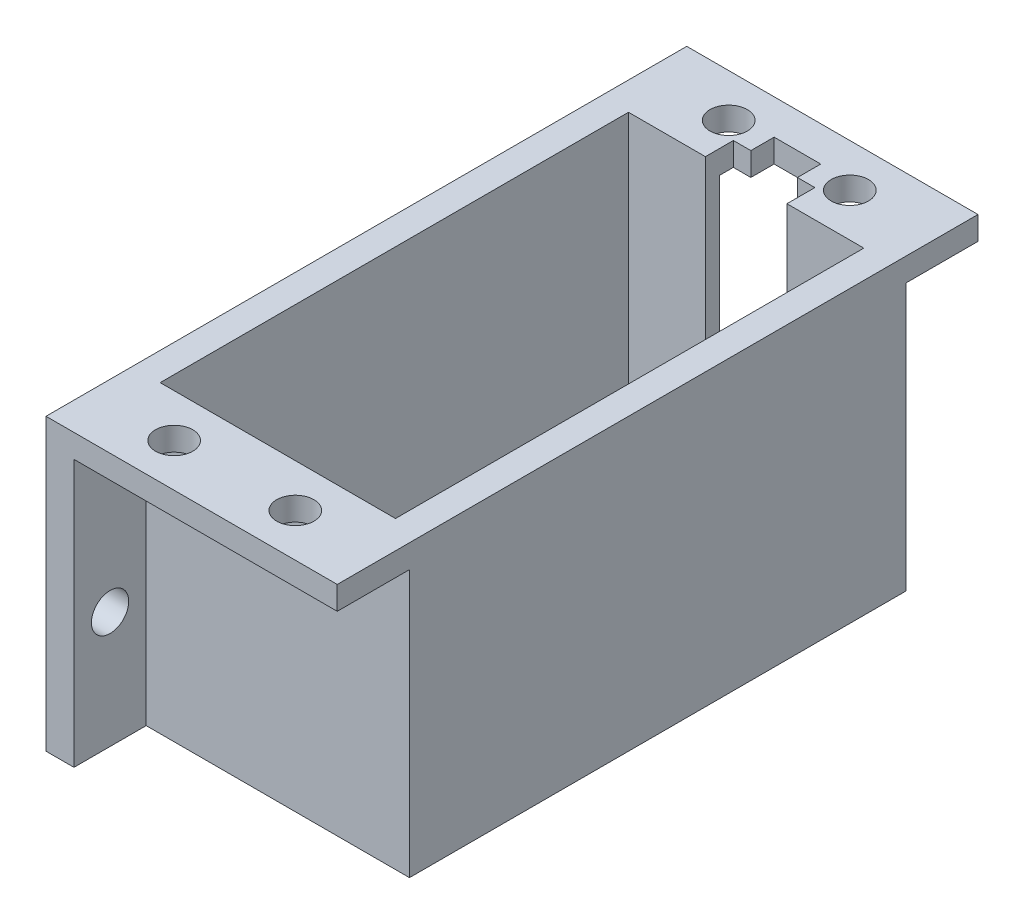
ISO-10303-21;
HEADER;
FILE_DESCRIPTION(('STEP AP214'),'2;1');
FILE_NAME('part.step','',(''),(''),'','','');
FILE_SCHEMA(('AUTOMOTIVE_DESIGN { 1 0 10303 214 1 1 1 1 }'));
ENDSEC;
DATA;
#1=APPLICATION_CONTEXT('core data for automotive mechanical design processes');
#2=APPLICATION_PROTOCOL_DEFINITION('international standard','automotive_design',2000,#1);
#3=PRODUCT_CONTEXT('',#1,'mechanical');
#4=PRODUCT('Part','Part','',(#3));
#5=PRODUCT_RELATED_PRODUCT_CATEGORY('part','',(#4));
#6=PRODUCT_DEFINITION_FORMATION('','',#4);
#7=PRODUCT_DEFINITION_CONTEXT('part definition',#1,'design');
#8=PRODUCT_DEFINITION('design','',#6,#7);
#9=PRODUCT_DEFINITION_SHAPE('','',#8);
#10=(LENGTH_UNIT() NAMED_UNIT(*) SI_UNIT(.MILLI.,.METRE.));
#11=(NAMED_UNIT(*) PLANE_ANGLE_UNIT() SI_UNIT($,.RADIAN.));
#12=(NAMED_UNIT(*) SI_UNIT($,.STERADIAN.) SOLID_ANGLE_UNIT());
#13=UNCERTAINTY_MEASURE_WITH_UNIT(LENGTH_MEASURE(1.E-05),#10,'distance_accuracy_value','');
#14=(GEOMETRIC_REPRESENTATION_CONTEXT(3) GLOBAL_UNCERTAINTY_ASSIGNED_CONTEXT((#13)) GLOBAL_UNIT_ASSIGNED_CONTEXT((#10,
#11,#12)) REPRESENTATION_CONTEXT('',''));
#15=CARTESIAN_POINT('',(0.,0.,0.));
#16=DIRECTION('',(0.,0.,1.));
#17=DIRECTION('',(1.,0.,0.));
#18=AXIS2_PLACEMENT_3D('',#15,#16,#17);
#19=CARTESIAN_POINT('',(12.5,-31.100643080168,4.));
#20=DIRECTION('',(1.,0.,0.));
#21=DIRECTION('',(0.,0.,-1.));
#22=AXIS2_PLACEMENT_3D('',#19,#20,#21);
#23=PLANE('',#22);
#24=DIRECTION('',(0.,0.,-1.));
#25=VECTOR('',#24,1.);
#26=CARTESIAN_POINT('',(12.5,24.9,4.));
#27=LINE('',#26,#25);
#28=CARTESIAN_POINT('',(12.5,24.9,27.5));
#29=VERTEX_POINT('',#28);
#30=CARTESIAN_POINT('',(12.5,24.9,21.3));
#31=VERTEX_POINT('',#30);
#32=EDGE_CURVE('E212',#29,#31,#27,.T.);
#33=ORIENTED_EDGE('',*,*,#32,.T.);
#34=DIRECTION('',(0.,-1.,0.));
#35=VECTOR('',#34,1.);
#36=CARTESIAN_POINT('',(12.5,-31.100643080168,21.3));
#37=LINE('',#36,#35);
#38=CARTESIAN_POINT('',(12.5,2.,21.3));
#39=VERTEX_POINT('',#38);
#40=EDGE_CURVE('E198',#31,#39,#37,.T.);
#41=ORIENTED_EDGE('',*,*,#40,.T.);
#42=DIRECTION('',(0.,0.,1.));
#43=VECTOR('',#42,1.);
#44=CARTESIAN_POINT('',(12.5,2.,4.));
#45=LINE('',#44,#43);
#46=CARTESIAN_POINT('',(12.5,2.,-21.3));
#47=VERTEX_POINT('',#46);
#48=EDGE_CURVE('E210',#47,#39,#45,.T.);
#49=ORIENTED_EDGE('',*,*,#48,.F.);
#50=DIRECTION('',(0.,1.,0.));
#51=VECTOR('',#50,1.);
#52=CARTESIAN_POINT('',(12.5,-31.100643080168,-21.3));
#53=LINE('',#52,#51);
#54=CARTESIAN_POINT('',(12.5,24.9,-21.3));
#55=VERTEX_POINT('',#54);
#56=EDGE_CURVE('E214',#47,#55,#53,.T.);
#57=ORIENTED_EDGE('',*,*,#56,.T.);
#58=DIRECTION('',(0.,0.,-1.));
#59=VECTOR('',#58,1.);
#60=CARTESIAN_POINT('',(12.5,24.9,4.));
#61=LINE('',#60,#59);
#62=CARTESIAN_POINT('',(12.5,24.9,-27.5));
#63=VERTEX_POINT('',#62);
#64=EDGE_CURVE('E440',#55,#63,#61,.T.);
#65=ORIENTED_EDGE('',*,*,#64,.T.);
#66=DIRECTION('',(0.,-1.,0.));
#67=VECTOR('',#66,1.);
#68=CARTESIAN_POINT('',(12.5,26.9,-27.5));
#69=LINE('',#68,#67);
#70=CARTESIAN_POINT('',(12.5,26.9,-27.5));
#71=VERTEX_POINT('',#70);
#72=EDGE_CURVE('E443',#71,#63,#69,.T.);
#73=ORIENTED_EDGE('',*,*,#72,.F.);
#74=DIRECTION('',(0.,0.,-1.));
#75=VECTOR('',#74,1.);
#76=CARTESIAN_POINT('',(12.5,26.9,-4.));
#77=LINE('',#76,#75);
#78=CARTESIAN_POINT('',(12.5,26.9,27.5));
#79=VERTEX_POINT('',#78);
#80=EDGE_CURVE('E318',#79,#71,#77,.T.);
#81=ORIENTED_EDGE('',*,*,#80,.F.);
#82=DIRECTION('',(0.,1.,0.));
#83=VECTOR('',#82,1.);
#84=CARTESIAN_POINT('',(12.5,2.,27.5));
#85=LINE('',#84,#83);
#86=EDGE_CURVE('E213',#29,#79,#85,.T.);
#87=ORIENTED_EDGE('',*,*,#86,.F.);
#88=EDGE_LOOP('',(#33,#41,#49,#57,#65,#73,#81,#87));
#89=FACE_BOUND('',#88,.T.);
#90=ADVANCED_FACE('F34',(#89),#23,.T.);
#91=CARTESIAN_POINT('',(0.,2.,0.));
#92=DIRECTION('',(0.,1.,0.));
#93=DIRECTION('',(0.,0.,1.));
#94=AXIS2_PLACEMENT_3D('',#91,#92,#93);
#95=PLANE('',#94);
#96=ORIENTED_EDGE('',*,*,#48,.T.);
#97=DIRECTION('',(1.,0.,0.));
#98=VECTOR('',#97,1.);
#99=CARTESIAN_POINT('',(-10.1,2.,21.3));
#100=LINE('',#99,#98);
#101=CARTESIAN_POINT('',(-10.1,2.,21.3));
#102=VERTEX_POINT('',#101);
#103=EDGE_CURVE('E194',#102,#39,#100,.T.);
#104=ORIENTED_EDGE('',*,*,#103,.F.);
#105=DIRECTION('',(0.,0.,1.));
#106=VECTOR('',#105,1.);
#107=CARTESIAN_POINT('',(-10.1,2.,22.5));
#108=LINE('',#107,#106);
#109=CARTESIAN_POINT('',(-10.1,2.,27.5));
#110=VERTEX_POINT('',#109);
#111=EDGE_CURVE('E220',#102,#110,#108,.T.);
#112=ORIENTED_EDGE('',*,*,#111,.T.);
#113=DIRECTION('',(1.,0.,0.));
#114=VECTOR('',#113,1.);
#115=CARTESIAN_POINT('',(-12.5,2.,27.5));
#116=LINE('',#115,#114);
#117=CARTESIAN_POINT('',(-12.5,2.,27.5));
#118=VERTEX_POINT('',#117);
#119=EDGE_CURVE('E459',#118,#110,#116,.T.);
#120=ORIENTED_EDGE('',*,*,#119,.F.);
#121=DIRECTION('',(0.,0.,-1.));
#122=VECTOR('',#121,1.);
#123=CARTESIAN_POINT('',(-12.5,2.,-4.));
#124=LINE('',#123,#122);
#125=CARTESIAN_POINT('',(-12.5,2.,-27.5));
#126=VERTEX_POINT('',#125);
#127=EDGE_CURVE('E223',#118,#126,#124,.T.);
#128=ORIENTED_EDGE('',*,*,#127,.T.);
#129=DIRECTION('',(-1.,0.,0.));
#130=VECTOR('',#129,1.);
#131=CARTESIAN_POINT('',(-10.1,2.,-27.5));
#132=LINE('',#131,#130);
#133=CARTESIAN_POINT('',(-10.1,2.,-27.5));
#134=VERTEX_POINT('',#133);
#135=EDGE_CURVE('E453',#134,#126,#132,.T.);
#136=ORIENTED_EDGE('',*,*,#135,.F.);
#137=DIRECTION('',(0.,0.,1.));
#138=VECTOR('',#137,1.);
#139=CARTESIAN_POINT('',(-10.1,2.,-29.5));
#140=LINE('',#139,#138);
#141=CARTESIAN_POINT('',(-10.1,2.,-21.3));
#142=VERTEX_POINT('',#141);
#143=EDGE_CURVE('E231',#134,#142,#140,.T.);
#144=ORIENTED_EDGE('',*,*,#143,.T.);
#145=DIRECTION('',(-1.,0.,0.));
#146=VECTOR('',#145,1.);
#147=CARTESIAN_POINT('',(0.,2.,-21.3));
#148=LINE('',#147,#146);
#149=CARTESIAN_POINT('',(-3.5,2.,-21.3));
#150=VERTEX_POINT('',#149);
#151=EDGE_CURVE('E41',#150,#142,#148,.T.);
#152=ORIENTED_EDGE('',*,*,#151,.F.);
#153=DIRECTION('',(0.,0.,1.));
#154=VECTOR('',#153,1.);
#155=CARTESIAN_POINT('',(-3.5,2.,-22.5));
#156=LINE('',#155,#154);
#157=CARTESIAN_POINT('',(-3.5,2.,-20.1));
#158=VERTEX_POINT('',#157);
#159=EDGE_CURVE('E233',#150,#158,#156,.T.);
#160=ORIENTED_EDGE('',*,*,#159,.T.);
#161=DIRECTION('',(-1.,0.,0.));
#162=VECTOR('',#161,1.);
#163=CARTESIAN_POINT('',(-3.5,2.,-20.1));
#164=LINE('',#163,#162);
#165=CARTESIAN_POINT('',(-10.1,2.,-20.1));
#166=VERTEX_POINT('',#165);
#167=EDGE_CURVE('E235',#158,#166,#164,.T.);
#168=ORIENTED_EDGE('',*,*,#167,.T.);
#169=DIRECTION('',(0.,0.,1.));
#170=VECTOR('',#169,1.);
#171=CARTESIAN_POINT('',(-10.1,2.,-20.1));
#172=LINE('',#171,#170);
#173=CARTESIAN_POINT('',(-10.1,2.,20.1));
#174=VERTEX_POINT('',#173);
#175=EDGE_CURVE('E237',#166,#174,#172,.T.);
#176=ORIENTED_EDGE('',*,*,#175,.T.);
#177=DIRECTION('',(1.,0.,0.));
#178=VECTOR('',#177,1.);
#179=CARTESIAN_POINT('',(-10.1,2.,20.1));
#180=LINE('',#179,#178);
#181=CARTESIAN_POINT('',(10.1,2.,20.1));
#182=VERTEX_POINT('',#181);
#183=EDGE_CURVE('E239',#174,#182,#180,.T.);
#184=ORIENTED_EDGE('',*,*,#183,.T.);
#185=DIRECTION('',(0.,0.,-1.));
#186=VECTOR('',#185,1.);
#187=CARTESIAN_POINT('',(10.1,2.,20.1));
#188=LINE('',#187,#186);
#189=CARTESIAN_POINT('',(10.1,2.,-20.1));
#190=VERTEX_POINT('',#189);
#191=EDGE_CURVE('E374',#182,#190,#188,.T.);
#192=ORIENTED_EDGE('',*,*,#191,.T.);
#193=DIRECTION('',(-1.,0.,0.));
#194=VECTOR('',#193,1.);
#195=CARTESIAN_POINT('',(10.1,2.,-20.1));
#196=LINE('',#195,#194);
#197=CARTESIAN_POINT('',(3.5,2.,-20.1));
#198=VERTEX_POINT('',#197);
#199=EDGE_CURVE('E225',#190,#198,#196,.T.);
#200=ORIENTED_EDGE('',*,*,#199,.T.);
#201=DIRECTION('',(0.,0.,-1.));
#202=VECTOR('',#201,1.);
#203=CARTESIAN_POINT('',(3.5,2.,-20.1));
#204=LINE('',#203,#202);
#205=CARTESIAN_POINT('',(3.5,2.,-21.3));
#206=VERTEX_POINT('',#205);
#207=EDGE_CURVE('E221',#198,#206,#204,.T.);
#208=ORIENTED_EDGE('',*,*,#207,.T.);
#209=DIRECTION('',(-1.,0.,0.));
#210=VECTOR('',#209,1.);
#211=CARTESIAN_POINT('',(10.1,2.,-21.3));
#212=LINE('',#211,#210);
#213=EDGE_CURVE('E218',#47,#206,#212,.T.);
#214=ORIENTED_EDGE('',*,*,#213,.F.);
#215=EDGE_LOOP('',(#96,#104,#112,#120,#128,#136,#144,#152,#160,#168,#176,#184,#192,#200,#208,#214));
#216=FACE_BOUND('',#215,.T.);
#217=ADVANCED_FACE('F216',(#216),#95,.F.);
#218=CARTESIAN_POINT('',(0.,0.,-27.5));
#219=DIRECTION('',(0.,0.,-1.));
#220=DIRECTION('',(-1.,0.,0.));
#221=AXIS2_PLACEMENT_3D('',#218,#219,#220);
#222=PLANE('',#221);
#223=ORIENTED_EDGE('',*,*,#72,.T.);
#224=DIRECTION('',(-1.,0.,0.));
#225=VECTOR('',#224,1.);
#226=CARTESIAN_POINT('',(10.1,24.9,-27.5));
#227=LINE('',#226,#225);
#228=CARTESIAN_POINT('',(-10.1,24.9,-27.5));
#229=VERTEX_POINT('',#228);
#230=EDGE_CURVE('E442',#63,#229,#227,.T.);
#231=ORIENTED_EDGE('',*,*,#230,.T.);
#232=DIRECTION('',(0.,-1.,0.));
#233=VECTOR('',#232,1.);
#234=CARTESIAN_POINT('',(-10.1,24.9,-27.5));
#235=LINE('',#234,#233);
#236=EDGE_CURVE('E56',#229,#134,#235,.T.);
#237=ORIENTED_EDGE('',*,*,#236,.T.);
#238=ORIENTED_EDGE('',*,*,#135,.T.);
#239=DIRECTION('',(0.,1.,0.));
#240=VECTOR('',#239,1.);
#241=CARTESIAN_POINT('',(-12.5,2.,-27.5));
#242=LINE('',#241,#240);
#243=CARTESIAN_POINT('',(-12.5,26.9,-27.5));
#244=VERTEX_POINT('',#243);
#245=EDGE_CURVE('E451',#126,#244,#242,.T.);
#246=ORIENTED_EDGE('',*,*,#245,.T.);
#247=DIRECTION('',(1.,0.,0.));
#248=VECTOR('',#247,1.);
#249=CARTESIAN_POINT('',(-12.5,26.9,-27.5));
#250=LINE('',#249,#248);
#251=EDGE_CURVE('E448',#244,#71,#250,.T.);
#252=ORIENTED_EDGE('',*,*,#251,.T.);
#253=EDGE_LOOP('',(#223,#231,#237,#238,#246,#252));
#254=FACE_BOUND('',#253,.T.);
#255=ADVANCED_FACE('F505',(#254),#222,.T.);
#256=CARTESIAN_POINT('',(0.,0.,27.5));
#257=DIRECTION('',(0.,0.,1.));
#258=DIRECTION('',(1.,0.,0.));
#259=AXIS2_PLACEMENT_3D('',#256,#257,#258);
#260=PLANE('',#259);
#261=DIRECTION('',(1.,0.,0.));
#262=VECTOR('',#261,1.);
#263=CARTESIAN_POINT('',(-10.1,24.9,27.5));
#264=LINE('',#263,#262);
#265=CARTESIAN_POINT('',(-10.1,24.9,27.5));
#266=VERTEX_POINT('',#265);
#267=EDGE_CURVE('E48',#266,#29,#264,.T.);
#268=ORIENTED_EDGE('',*,*,#267,.T.);
#269=ORIENTED_EDGE('',*,*,#86,.T.);
#270=DIRECTION('',(-1.,0.,0.));
#271=VECTOR('',#270,1.);
#272=CARTESIAN_POINT('',(12.5,26.9,27.5));
#273=LINE('',#272,#271);
#274=CARTESIAN_POINT('',(-12.5,26.9,27.5));
#275=VERTEX_POINT('',#274);
#276=EDGE_CURVE('E464',#79,#275,#273,.T.);
#277=ORIENTED_EDGE('',*,*,#276,.T.);
#278=DIRECTION('',(0.,-1.,0.));
#279=VECTOR('',#278,1.);
#280=CARTESIAN_POINT('',(-12.5,26.9,27.5));
#281=LINE('',#280,#279);
#282=EDGE_CURVE('E461',#275,#118,#281,.T.);
#283=ORIENTED_EDGE('',*,*,#282,.T.);
#284=ORIENTED_EDGE('',*,*,#119,.T.);
#285=DIRECTION('',(0.,1.,0.));
#286=VECTOR('',#285,1.);
#287=CARTESIAN_POINT('',(-10.1,2.,27.5));
#288=LINE('',#287,#286);
#289=EDGE_CURVE('E457',#110,#266,#288,.T.);
#290=ORIENTED_EDGE('',*,*,#289,.T.);
#291=EDGE_LOOP('',(#268,#269,#277,#283,#284,#290));
#292=FACE_BOUND('',#291,.T.);
#293=ADVANCED_FACE('F496',(#292),#260,.T.);
#294=CARTESIAN_POINT('',(-12.5,-31.100643080168,22.5));
#295=DIRECTION('',(-1.,0.,0.));
#296=DIRECTION('',(0.,0.,1.));
#297=AXIS2_PLACEMENT_3D('',#294,#295,#296);
#298=PLANE('',#297);
#299=CARTESIAN_POINT('',(-12.5,12.,24.4));
#300=DIRECTION('',(-1.,0.,0.));
#301=DIRECTION('',(0.,0.,1.));
#302=AXIS2_PLACEMENT_3D('',#299,#300,#301);
#303=CIRCLE('',#302,1.6);
#304=CARTESIAN_POINT('',(-12.5,12.,26.));
#305=VERTEX_POINT('',#304);
#306=EDGE_CURVE('E471',#305,#305,#303,.T.);
#307=ORIENTED_EDGE('',*,*,#306,.F.);
#308=EDGE_LOOP('',(#307));
#309=FACE_BOUND('',#308,.T.);
#310=CARTESIAN_POINT('',(-12.5,12.,-24.4));
#311=DIRECTION('',(-1.,0.,0.));
#312=DIRECTION('',(0.,0.,1.));
#313=AXIS2_PLACEMENT_3D('',#310,#311,#312);
#314=CIRCLE('',#313,1.6);
#315=CARTESIAN_POINT('',(-12.5,12.,-22.8));
#316=VERTEX_POINT('',#315);
#317=EDGE_CURVE('E474',#316,#316,#314,.T.);
#318=ORIENTED_EDGE('',*,*,#317,.F.);
#319=EDGE_LOOP('',(#318));
#320=FACE_BOUND('',#319,.T.);
#321=ORIENTED_EDGE('',*,*,#282,.F.);
#322=DIRECTION('',(0.,0.,1.));
#323=VECTOR('',#322,1.);
#324=CARTESIAN_POINT('',(-12.5,26.9,-22.5));
#325=LINE('',#324,#323);
#326=EDGE_CURVE('E320',#244,#275,#325,.T.);
#327=ORIENTED_EDGE('',*,*,#326,.F.);
#328=ORIENTED_EDGE('',*,*,#245,.F.);
#329=ORIENTED_EDGE('',*,*,#127,.F.);
#330=EDGE_LOOP('',(#321,#327,#328,#329));
#331=FACE_BOUND('',#330,.T.);
#332=ADVANCED_FACE('F503',(#309,#320,#331),#298,.T.);
#333=CARTESIAN_POINT('',(0.,26.9,0.));
#334=DIRECTION('',(0.,1.,0.));
#335=DIRECTION('',(0.,0.,1.));
#336=AXIS2_PLACEMENT_3D('',#333,#334,#335);
#337=PLANE('',#336);
#338=DIRECTION('',(0.,0.,-1.));
#339=VECTOR('',#338,1.);
#340=CARTESIAN_POINT('',(2.,26.9,-24.5));
#341=LINE('',#340,#339);
#342=CARTESIAN_POINT('',(2.,26.9,-22.5));
#343=VERTEX_POINT('',#342);
#344=CARTESIAN_POINT('',(2.,26.9,-24.5));
#345=VERTEX_POINT('',#344);
#346=EDGE_CURVE('E241',#343,#345,#341,.T.);
#347=ORIENTED_EDGE('',*,*,#346,.F.);
#348=DIRECTION('',(-1.,0.,0.));
#349=VECTOR('',#348,1.);
#350=CARTESIAN_POINT('',(0.,26.9,-22.5));
#351=LINE('',#350,#349);
#352=CARTESIAN_POINT('',(3.5,26.9,-22.5));
#353=VERTEX_POINT('',#352);
#354=EDGE_CURVE('E275',#353,#343,#351,.T.);
#355=ORIENTED_EDGE('',*,*,#354,.F.);
#356=DIRECTION('',(0.,0.,-1.));
#357=VECTOR('',#356,1.);
#358=CARTESIAN_POINT('',(3.5,26.9,0.));
#359=LINE('',#358,#357);
#360=CARTESIAN_POINT('',(3.5,26.9,-20.1));
#361=VERTEX_POINT('',#360);
#362=EDGE_CURVE('E336',#361,#353,#359,.T.);
#363=ORIENTED_EDGE('',*,*,#362,.F.);
#364=DIRECTION('',(-1.,0.,0.));
#365=VECTOR('',#364,1.);
#366=CARTESIAN_POINT('',(-5.1,26.9,-20.1));
#367=LINE('',#366,#365);
#368=CARTESIAN_POINT('',(10.1,26.9,-20.1));
#369=VERTEX_POINT('',#368);
#370=EDGE_CURVE('E315',#369,#361,#367,.T.);
#371=ORIENTED_EDGE('',*,*,#370,.F.);
#372=DIRECTION('',(0.,0.,-1.));
#373=VECTOR('',#372,1.);
#374=CARTESIAN_POINT('',(10.1,26.9,0.));
#375=LINE('',#374,#373);
#376=CARTESIAN_POINT('',(10.1,26.9,20.1));
#377=VERTEX_POINT('',#376);
#378=EDGE_CURVE('E328',#377,#369,#375,.T.);
#379=ORIENTED_EDGE('',*,*,#378,.F.);
#380=DIRECTION('',(1.,0.,0.));
#381=VECTOR('',#380,1.);
#382=CARTESIAN_POINT('',(-5.1,26.9,20.1));
#383=LINE('',#382,#381);
#384=CARTESIAN_POINT('',(-10.1,26.9,20.1));
#385=VERTEX_POINT('',#384);
#386=EDGE_CURVE('E312',#385,#377,#383,.T.);
#387=ORIENTED_EDGE('',*,*,#386,.F.);
#388=DIRECTION('',(0.,0.,1.));
#389=VECTOR('',#388,1.);
#390=CARTESIAN_POINT('',(-10.1,26.9,0.));
#391=LINE('',#390,#389);
#392=CARTESIAN_POINT('',(-10.1,26.9,-20.1));
#393=VERTEX_POINT('',#392);
#394=EDGE_CURVE('E331',#393,#385,#391,.T.);
#395=ORIENTED_EDGE('',*,*,#394,.F.);
#396=CARTESIAN_POINT('',(-3.5,26.9,-20.1));
#397=VERTEX_POINT('',#396);
#398=EDGE_CURVE('E314',#397,#393,#367,.T.);
#399=ORIENTED_EDGE('',*,*,#398,.F.);
#400=DIRECTION('',(0.,0.,1.));
#401=VECTOR('',#400,1.);
#402=CARTESIAN_POINT('',(-3.5,26.9,0.));
#403=LINE('',#402,#401);
#404=CARTESIAN_POINT('',(-3.5,26.9,-22.5));
#405=VERTEX_POINT('',#404);
#406=EDGE_CURVE('E334',#405,#397,#403,.T.);
#407=ORIENTED_EDGE('',*,*,#406,.F.);
#408=CARTESIAN_POINT('',(-2.,26.9,-22.5));
#409=VERTEX_POINT('',#408);
#410=EDGE_CURVE('E266',#409,#405,#351,.T.);
#411=ORIENTED_EDGE('',*,*,#410,.F.);
#412=DIRECTION('',(0.,0.,1.));
#413=VECTOR('',#412,1.);
#414=CARTESIAN_POINT('',(-2.,26.9,-24.5));
#415=LINE('',#414,#413);
#416=CARTESIAN_POINT('',(-2.,26.9,-24.5));
#417=VERTEX_POINT('',#416);
#418=EDGE_CURVE('E247',#417,#409,#415,.T.);
#419=ORIENTED_EDGE('',*,*,#418,.F.);
#420=DIRECTION('',(-1.,0.,0.));
#421=VECTOR('',#420,1.);
#422=CARTESIAN_POINT('',(-2.,26.9,-24.5));
#423=LINE('',#422,#421);
#424=EDGE_CURVE('E244',#345,#417,#423,.T.);
#425=ORIENTED_EDGE('',*,*,#424,.F.);
#426=EDGE_LOOP('',(#347,#355,#363,#371,#379,#387,#395,#399,#407,#411,#419,#425));
#427=FACE_BOUND('',#426,.T.);
#428=CARTESIAN_POINT('',(5.2,26.9,-23.8));
#429=DIRECTION('',(0.,-1.,0.));
#430=DIRECTION('',(0.,0.,-1.));
#431=AXIS2_PLACEMENT_3D('',#428,#429,#430);
#432=CIRCLE('',#431,1.6);
#433=CARTESIAN_POINT('',(5.2,26.9,-25.4));
#434=VERTEX_POINT('',#433);
#435=EDGE_CURVE('E282',#434,#434,#432,.T.);
#436=ORIENTED_EDGE('',*,*,#435,.T.);
#437=EDGE_LOOP('',(#436));
#438=FACE_BOUND('',#437,.T.);
#439=CARTESIAN_POINT('',(-5.2,26.9,23.8));
#440=DIRECTION('',(0.,-1.,0.));
#441=DIRECTION('',(0.,0.,-1.));
#442=AXIS2_PLACEMENT_3D('',#439,#440,#441);
#443=CIRCLE('',#442,1.6);
#444=CARTESIAN_POINT('',(-5.2,26.9,22.2));
#445=VERTEX_POINT('',#444);
#446=EDGE_CURVE('E298',#445,#445,#443,.T.);
#447=ORIENTED_EDGE('',*,*,#446,.T.);
#448=EDGE_LOOP('',(#447));
#449=FACE_BOUND('',#448,.T.);
#450=CARTESIAN_POINT('',(5.2,26.9,23.8));
#451=DIRECTION('',(0.,-1.,0.));
#452=DIRECTION('',(0.,0.,-1.));
#453=AXIS2_PLACEMENT_3D('',#450,#451,#452);
#454=CIRCLE('',#453,1.6);
#455=CARTESIAN_POINT('',(5.2,26.9,22.2));
#456=VERTEX_POINT('',#455);
#457=EDGE_CURVE('E291',#456,#456,#454,.T.);
#458=ORIENTED_EDGE('',*,*,#457,.T.);
#459=EDGE_LOOP('',(#458));
#460=FACE_BOUND('',#459,.T.);
#461=CARTESIAN_POINT('',(-5.2,26.9,-23.8));
#462=DIRECTION('',(0.,-1.,0.));
#463=DIRECTION('',(0.,0.,-1.));
#464=AXIS2_PLACEMENT_3D('',#461,#462,#463);
#465=CIRCLE('',#464,1.6);
#466=CARTESIAN_POINT('',(-5.2,26.9,-25.4));
#467=VERTEX_POINT('',#466);
#468=EDGE_CURVE('E294',#467,#467,#465,.T.);
#469=ORIENTED_EDGE('',*,*,#468,.T.);
#470=EDGE_LOOP('',(#469));
#471=FACE_BOUND('',#470,.T.);
#472=ORIENTED_EDGE('',*,*,#326,.T.);
#473=ORIENTED_EDGE('',*,*,#276,.F.);
#474=ORIENTED_EDGE('',*,*,#80,.T.);
#475=ORIENTED_EDGE('',*,*,#251,.F.);
#476=EDGE_LOOP('',(#472,#473,#474,#475));
#477=FACE_BOUND('',#476,.T.);
#478=ADVANCED_FACE('F388',(#427,#438,#449,#460,#471,#477),#337,.T.);
#479=CARTESIAN_POINT('',(0.,24.9,0.));
#480=DIRECTION('',(0.,1.,0.));
#481=DIRECTION('',(0.,0.,1.));
#482=AXIS2_PLACEMENT_3D('',#479,#480,#481);
#483=PLANE('',#482);
#484=CARTESIAN_POINT('',(5.2,24.9,23.8));
#485=DIRECTION('',(0.,-1.,0.));
#486=DIRECTION('',(0.,0.,-1.));
#487=AXIS2_PLACEMENT_3D('',#484,#485,#486);
#488=CIRCLE('',#487,1.6);
#489=CARTESIAN_POINT('',(5.2,24.9,22.2));
#490=VERTEX_POINT('',#489);
#491=EDGE_CURVE('E295',#490,#490,#488,.T.);
#492=ORIENTED_EDGE('',*,*,#491,.F.);
#493=EDGE_LOOP('',(#492));
#494=FACE_BOUND('',#493,.T.);
#495=CARTESIAN_POINT('',(-5.2,24.9,23.8));
#496=DIRECTION('',(0.,-1.,0.));
#497=DIRECTION('',(0.,0.,-1.));
#498=AXIS2_PLACEMENT_3D('',#495,#496,#497);
#499=CIRCLE('',#498,1.6);
#500=CARTESIAN_POINT('',(-5.2,24.9,22.2));
#501=VERTEX_POINT('',#500);
#502=EDGE_CURVE('E301',#501,#501,#499,.T.);
#503=ORIENTED_EDGE('',*,*,#502,.F.);
#504=EDGE_LOOP('',(#503));
#505=FACE_BOUND('',#504,.T.);
#506=ORIENTED_EDGE('',*,*,#267,.F.);
#507=DIRECTION('',(0.,0.,1.));
#508=VECTOR('',#507,1.);
#509=CARTESIAN_POINT('',(-10.1,24.9,29.5));
#510=LINE('',#509,#508);
#511=CARTESIAN_POINT('',(-10.1,24.9,21.3));
#512=VERTEX_POINT('',#511);
#513=EDGE_CURVE('E259',#512,#266,#510,.T.);
#514=ORIENTED_EDGE('',*,*,#513,.F.);
#515=DIRECTION('',(-1.,0.,0.));
#516=VECTOR('',#515,1.);
#517=CARTESIAN_POINT('',(10.1,24.9,21.3));
#518=LINE('',#517,#516);
#519=EDGE_CURVE('E205',#31,#512,#518,.T.);
#520=ORIENTED_EDGE('',*,*,#519,.F.);
#521=ORIENTED_EDGE('',*,*,#32,.F.);
#522=EDGE_LOOP('',(#506,#514,#520,#521));
#523=FACE_BOUND('',#522,.T.);
#524=ADVANCED_FACE('F489',(#494,#505,#523),#483,.F.);
#525=CARTESIAN_POINT('',(-10.1,32.3,29.5));
#526=DIRECTION('',(1.,0.,0.));
#527=DIRECTION('',(0.,0.,-1.));
#528=AXIS2_PLACEMENT_3D('',#525,#526,#527);
#529=PLANE('',#528);
#530=CARTESIAN_POINT('',(-10.1,12.,24.4));
#531=DIRECTION('',(1.,0.,0.));
#532=DIRECTION('',(0.,0.,-1.));
#533=AXIS2_PLACEMENT_3D('',#530,#531,#532);
#534=CIRCLE('',#533,1.6);
#535=CARTESIAN_POINT('',(-10.1,12.,22.8));
#536=VERTEX_POINT('',#535);
#537=EDGE_CURVE('E477',#536,#536,#534,.T.);
#538=ORIENTED_EDGE('',*,*,#537,.F.);
#539=EDGE_LOOP('',(#538));
#540=FACE_BOUND('',#539,.T.);
#541=ORIENTED_EDGE('',*,*,#513,.T.);
#542=ORIENTED_EDGE('',*,*,#289,.F.);
#543=ORIENTED_EDGE('',*,*,#111,.F.);
#544=DIRECTION('',(0.,-1.,0.));
#545=VECTOR('',#544,1.);
#546=CARTESIAN_POINT('',(-10.1,24.9,21.3));
#547=LINE('',#546,#545);
#548=EDGE_CURVE('E201',#512,#102,#547,.T.);
#549=ORIENTED_EDGE('',*,*,#548,.F.);
#550=EDGE_LOOP('',(#541,#542,#543,#549));
#551=FACE_BOUND('',#550,.T.);
#552=ADVANCED_FACE('F486',(#540,#551),#529,.T.);
#553=CARTESIAN_POINT('',(0.,24.9,0.));
#554=DIRECTION('',(0.,-1.,0.));
#555=DIRECTION('',(0.,0.,-1.));
#556=AXIS2_PLACEMENT_3D('',#553,#554,#555);
#557=PLANE('',#556);
#558=CARTESIAN_POINT('',(-5.2,24.9,-23.8));
#559=DIRECTION('',(0.,-1.,0.));
#560=DIRECTION('',(0.,0.,-1.));
#561=AXIS2_PLACEMENT_3D('',#558,#559,#560);
#562=CIRCLE('',#561,1.6);
#563=CARTESIAN_POINT('',(-5.2,24.9,-25.4));
#564=VERTEX_POINT('',#563);
#565=EDGE_CURVE('E322',#564,#564,#562,.T.);
#566=ORIENTED_EDGE('',*,*,#565,.F.);
#567=EDGE_LOOP('',(#566));
#568=FACE_BOUND('',#567,.T.);
#569=CARTESIAN_POINT('',(5.2,24.9,-23.8));
#570=DIRECTION('',(0.,-1.,0.));
#571=DIRECTION('',(0.,0.,-1.));
#572=AXIS2_PLACEMENT_3D('',#569,#570,#571);
#573=CIRCLE('',#572,1.6);
#574=CARTESIAN_POINT('',(5.2,24.9,-25.4));
#575=VERTEX_POINT('',#574);
#576=EDGE_CURVE('E325',#575,#575,#573,.T.);
#577=ORIENTED_EDGE('',*,*,#576,.F.);
#578=EDGE_LOOP('',(#577));
#579=FACE_BOUND('',#578,.T.);
#580=DIRECTION('',(0.,0.,1.));
#581=VECTOR('',#580,1.);
#582=CARTESIAN_POINT('',(-10.1,24.9,-22.5));
#583=LINE('',#582,#581);
#584=CARTESIAN_POINT('',(-10.1,24.9,-21.3));
#585=VERTEX_POINT('',#584);
#586=EDGE_CURVE('E257',#229,#585,#583,.T.);
#587=ORIENTED_EDGE('',*,*,#586,.F.);
#588=ORIENTED_EDGE('',*,*,#230,.F.);
#589=ORIENTED_EDGE('',*,*,#64,.F.);
#590=DIRECTION('',(1.,0.,0.));
#591=VECTOR('',#590,1.);
#592=CARTESIAN_POINT('',(-10.1,24.9,-21.3));
#593=LINE('',#592,#591);
#594=CARTESIAN_POINT('',(3.5,24.9,-21.3));
#595=VERTEX_POINT('',#594);
#596=EDGE_CURVE('E438',#595,#55,#593,.T.);
#597=ORIENTED_EDGE('',*,*,#596,.F.);
#598=DIRECTION('',(0.,0.,1.));
#599=VECTOR('',#598,1.);
#600=CARTESIAN_POINT('',(3.5,24.9,-20.1));
#601=LINE('',#600,#599);
#602=CARTESIAN_POINT('',(3.5,24.9,-22.5));
#603=VERTEX_POINT('',#602);
#604=EDGE_CURVE('E369',#603,#595,#601,.T.);
#605=ORIENTED_EDGE('',*,*,#604,.F.);
#606=DIRECTION('',(1.,0.,0.));
#607=VECTOR('',#606,1.);
#608=CARTESIAN_POINT('',(-12.5,24.9,-22.5));
#609=LINE('',#608,#607);
#610=CARTESIAN_POINT('',(2.,24.9,-22.5));
#611=VERTEX_POINT('',#610);
#612=EDGE_CURVE('E308',#611,#603,#609,.T.);
#613=ORIENTED_EDGE('',*,*,#612,.F.);
#614=DIRECTION('',(0.,0.,1.));
#615=VECTOR('',#614,1.);
#616=CARTESIAN_POINT('',(2.,24.9,0.));
#617=LINE('',#616,#615);
#618=CARTESIAN_POINT('',(2.,24.9,-24.5));
#619=VERTEX_POINT('',#618);
#620=EDGE_CURVE('E255',#619,#611,#617,.T.);
#621=ORIENTED_EDGE('',*,*,#620,.F.);
#622=DIRECTION('',(1.,0.,0.));
#623=VECTOR('',#622,1.);
#624=CARTESIAN_POINT('',(0.,24.9,-24.5));
#625=LINE('',#624,#623);
#626=CARTESIAN_POINT('',(-2.,24.9,-24.5));
#627=VERTEX_POINT('',#626);
#628=EDGE_CURVE('E344',#627,#619,#625,.T.);
#629=ORIENTED_EDGE('',*,*,#628,.F.);
#630=DIRECTION('',(0.,0.,-1.));
#631=VECTOR('',#630,1.);
#632=CARTESIAN_POINT('',(-2.,24.9,0.));
#633=LINE('',#632,#631);
#634=CARTESIAN_POINT('',(-2.,24.9,-22.5));
#635=VERTEX_POINT('',#634);
#636=EDGE_CURVE('E252',#635,#627,#633,.T.);
#637=ORIENTED_EDGE('',*,*,#636,.F.);
#638=CARTESIAN_POINT('',(-3.5,24.9,-22.5));
#639=VERTEX_POINT('',#638);
#640=EDGE_CURVE('E311',#639,#635,#609,.T.);
#641=ORIENTED_EDGE('',*,*,#640,.F.);
#642=DIRECTION('',(0.,0.,-1.));
#643=VECTOR('',#642,1.);
#644=CARTESIAN_POINT('',(-3.5,24.9,-22.5));
#645=LINE('',#644,#643);
#646=CARTESIAN_POINT('',(-3.5,24.9,-21.3));
#647=VERTEX_POINT('',#646);
#648=EDGE_CURVE('E11',#647,#639,#645,.T.);
#649=ORIENTED_EDGE('',*,*,#648,.F.);
#650=EDGE_CURVE('E364',#585,#647,#593,.T.);
#651=ORIENTED_EDGE('',*,*,#650,.F.);
#652=EDGE_LOOP('',(#587,#588,#589,#597,#605,#613,#621,#629,#637,#641,#649,#651));
#653=FACE_BOUND('',#652,.T.);
#654=ADVANCED_FACE('F425',(#568,#579,#653),#557,.T.);
#655=CARTESIAN_POINT('',(-10.1,32.3,-22.5));
#656=DIRECTION('',(1.,0.,0.));
#657=DIRECTION('',(0.,0.,-1.));
#658=AXIS2_PLACEMENT_3D('',#655,#656,#657);
#659=PLANE('',#658);
#660=CARTESIAN_POINT('',(-10.1,12.,-24.4));
#661=DIRECTION('',(1.,0.,0.));
#662=DIRECTION('',(0.,0.,-1.));
#663=AXIS2_PLACEMENT_3D('',#660,#661,#662);
#664=CIRCLE('',#663,1.6);
#665=CARTESIAN_POINT('',(-10.1,12.,-26.));
#666=VERTEX_POINT('',#665);
#667=EDGE_CURVE('E478',#666,#666,#664,.T.);
#668=ORIENTED_EDGE('',*,*,#667,.F.);
#669=EDGE_LOOP('',(#668));
#670=FACE_BOUND('',#669,.T.);
#671=ORIENTED_EDGE('',*,*,#143,.F.);
#672=ORIENTED_EDGE('',*,*,#236,.F.);
#673=ORIENTED_EDGE('',*,*,#586,.T.);
#674=DIRECTION('',(0.,1.,0.));
#675=VECTOR('',#674,1.);
#676=CARTESIAN_POINT('',(-10.1,2.,-21.3));
#677=LINE('',#676,#675);
#678=EDGE_CURVE('E352',#142,#585,#677,.T.);
#679=ORIENTED_EDGE('',*,*,#678,.F.);
#680=EDGE_LOOP('',(#671,#672,#673,#679));
#681=FACE_BOUND('',#680,.T.);
#682=ADVANCED_FACE('F358',(#670,#681),#659,.T.);
#683=CARTESIAN_POINT('',(3.5,77.,-22.5));
#684=DIRECTION('',(0.,0.,-1.));
#685=DIRECTION('',(-1.,0.,0.));
#686=AXIS2_PLACEMENT_3D('',#683,#684,#685);
#687=PLANE('',#686);
#688=ORIENTED_EDGE('',*,*,#354,.T.);
#689=DIRECTION('',(0.,-1.,0.));
#690=VECTOR('',#689,1.);
#691=CARTESIAN_POINT('',(2.,77.,-22.5));
#692=LINE('',#691,#690);
#693=EDGE_CURVE('E341',#343,#611,#692,.T.);
#694=ORIENTED_EDGE('',*,*,#693,.T.);
#695=ORIENTED_EDGE('',*,*,#612,.T.);
#696=DIRECTION('',(0.,-1.,0.));
#697=VECTOR('',#696,1.);
#698=CARTESIAN_POINT('',(3.5,77.,-22.5));
#699=LINE('',#698,#697);
#700=EDGE_CURVE('E267',#353,#603,#699,.T.);
#701=ORIENTED_EDGE('',*,*,#700,.F.);
#702=EDGE_LOOP('',(#688,#694,#695,#701));
#703=FACE_BOUND('',#702,.T.);
#704=ADVANCED_FACE('F435',(#703),#687,.F.);
#705=CARTESIAN_POINT('',(-5.1,-16.5,-20.1));
#706=DIRECTION('',(0.,0.,-1.));
#707=DIRECTION('',(-1.,0.,0.));
#708=AXIS2_PLACEMENT_3D('',#705,#706,#707);
#709=PLANE('',#708);
#710=DIRECTION('',(0.,-1.,0.));
#711=VECTOR('',#710,1.);
#712=CARTESIAN_POINT('',(3.5,77.,-20.1));
#713=LINE('',#712,#711);
#714=EDGE_CURVE('E263',#361,#198,#713,.T.);
#715=ORIENTED_EDGE('',*,*,#714,.T.);
#716=ORIENTED_EDGE('',*,*,#199,.F.);
#717=DIRECTION('',(0.,-1.,0.));
#718=VECTOR('',#717,1.);
#719=CARTESIAN_POINT('',(10.1,77.,-20.1));
#720=LINE('',#719,#718);
#721=EDGE_CURVE('E279',#369,#190,#720,.T.);
#722=ORIENTED_EDGE('',*,*,#721,.F.);
#723=ORIENTED_EDGE('',*,*,#370,.T.);
#724=EDGE_LOOP('',(#715,#716,#722,#723));
#725=FACE_BOUND('',#724,.T.);
#726=ADVANCED_FACE('F384',(#725),#709,.F.);
#727=CARTESIAN_POINT('',(-5.1,-16.5,20.1));
#728=DIRECTION('',(0.,0.,1.));
#729=DIRECTION('',(1.,0.,0.));
#730=AXIS2_PLACEMENT_3D('',#727,#728,#729);
#731=PLANE('',#730);
#732=DIRECTION('',(0.,-1.,0.));
#733=VECTOR('',#732,1.);
#734=CARTESIAN_POINT('',(10.1,77.,20.1));
#735=LINE('',#734,#733);
#736=EDGE_CURVE('E278',#377,#182,#735,.T.);
#737=ORIENTED_EDGE('',*,*,#736,.T.);
#738=ORIENTED_EDGE('',*,*,#183,.F.);
#739=DIRECTION('',(0.,-1.,0.));
#740=VECTOR('',#739,1.);
#741=CARTESIAN_POINT('',(-10.1,77.,20.1));
#742=LINE('',#741,#740);
#743=EDGE_CURVE('E286',#385,#174,#742,.T.);
#744=ORIENTED_EDGE('',*,*,#743,.F.);
#745=ORIENTED_EDGE('',*,*,#386,.T.);
#746=EDGE_LOOP('',(#737,#738,#744,#745));
#747=FACE_BOUND('',#746,.T.);
#748=ADVANCED_FACE('F396',(#747),#731,.F.);
#749=DIRECTION('',(0.,-1.,0.));
#750=VECTOR('',#749,1.);
#751=CARTESIAN_POINT('',(-10.1,77.,-20.1));
#752=LINE('',#751,#750);
#753=EDGE_CURVE('E283',#393,#166,#752,.T.);
#754=ORIENTED_EDGE('',*,*,#753,.T.);
#755=ORIENTED_EDGE('',*,*,#167,.F.);
#756=DIRECTION('',(0.,-1.,0.));
#757=VECTOR('',#756,1.);
#758=CARTESIAN_POINT('',(-3.5,77.,-20.1));
#759=LINE('',#758,#757);
#760=EDGE_CURVE('E262',#397,#158,#759,.T.);
#761=ORIENTED_EDGE('',*,*,#760,.F.);
#762=ORIENTED_EDGE('',*,*,#398,.T.);
#763=EDGE_LOOP('',(#754,#755,#761,#762));
#764=FACE_BOUND('',#763,.T.);
#765=ADVANCED_FACE('F407',(#764),#709,.F.);
#766=CARTESIAN_POINT('',(5.2,26.9,23.8));
#767=DIRECTION('',(0.,-1.,0.));
#768=DIRECTION('',(0.,0.,-1.));
#769=AXIS2_PLACEMENT_3D('',#766,#767,#768);
#770=CYLINDRICAL_SURFACE('',#769,1.6);
#771=ORIENTED_EDGE('',*,*,#457,.F.);
#772=EDGE_LOOP('',(#771));
#773=FACE_BOUND('',#772,.T.);
#774=ORIENTED_EDGE('',*,*,#491,.T.);
#775=EDGE_LOOP('',(#774));
#776=FACE_BOUND('',#775,.T.);
#777=ADVANCED_FACE('F549',(#773,#776),#770,.F.);
#778=CARTESIAN_POINT('',(-5.2,26.9,23.8));
#779=DIRECTION('',(0.,-1.,0.));
#780=DIRECTION('',(0.,0.,-1.));
#781=AXIS2_PLACEMENT_3D('',#778,#779,#780);
#782=CYLINDRICAL_SURFACE('',#781,1.6);
#783=ORIENTED_EDGE('',*,*,#446,.F.);
#784=EDGE_LOOP('',(#783));
#785=FACE_BOUND('',#784,.T.);
#786=ORIENTED_EDGE('',*,*,#502,.T.);
#787=EDGE_LOOP('',(#786));
#788=FACE_BOUND('',#787,.T.);
#789=ADVANCED_FACE('F552',(#785,#788),#782,.F.);
#790=CARTESIAN_POINT('',(-5.2,26.9,-23.8));
#791=DIRECTION('',(0.,-1.,0.));
#792=DIRECTION('',(0.,0.,-1.));
#793=AXIS2_PLACEMENT_3D('',#790,#791,#792);
#794=CYLINDRICAL_SURFACE('',#793,1.6);
#795=ORIENTED_EDGE('',*,*,#468,.F.);
#796=EDGE_LOOP('',(#795));
#797=FACE_BOUND('',#796,.T.);
#798=ORIENTED_EDGE('',*,*,#565,.T.);
#799=EDGE_LOOP('',(#798));
#800=FACE_BOUND('',#799,.T.);
#801=ADVANCED_FACE('F556',(#797,#800),#794,.F.);
#802=CARTESIAN_POINT('',(5.2,26.9,-23.8));
#803=DIRECTION('',(0.,-1.,0.));
#804=DIRECTION('',(0.,0.,-1.));
#805=AXIS2_PLACEMENT_3D('',#802,#803,#804);
#806=CYLINDRICAL_SURFACE('',#805,1.6);
#807=ORIENTED_EDGE('',*,*,#435,.F.);
#808=EDGE_LOOP('',(#807));
#809=FACE_BOUND('',#808,.T.);
#810=ORIENTED_EDGE('',*,*,#576,.T.);
#811=EDGE_LOOP('',(#810));
#812=FACE_BOUND('',#811,.T.);
#813=ADVANCED_FACE('F548',(#809,#812),#806,.F.);
#814=CARTESIAN_POINT('',(10.1,77.,20.1));
#815=DIRECTION('',(1.,0.,0.));
#816=DIRECTION('',(0.,0.,-1.));
#817=AXIS2_PLACEMENT_3D('',#814,#815,#816);
#818=PLANE('',#817);
#819=ORIENTED_EDGE('',*,*,#721,.T.);
#820=ORIENTED_EDGE('',*,*,#191,.F.);
#821=ORIENTED_EDGE('',*,*,#736,.F.);
#822=ORIENTED_EDGE('',*,*,#378,.T.);
#823=EDGE_LOOP('',(#819,#820,#821,#822));
#824=FACE_BOUND('',#823,.T.);
#825=ADVANCED_FACE('F393',(#824),#818,.F.);
#826=CARTESIAN_POINT('',(-10.1,77.,20.1));
#827=DIRECTION('',(-1.,0.,0.));
#828=DIRECTION('',(0.,0.,1.));
#829=AXIS2_PLACEMENT_3D('',#826,#827,#828);
#830=PLANE('',#829);
#831=ORIENTED_EDGE('',*,*,#743,.T.);
#832=ORIENTED_EDGE('',*,*,#175,.F.);
#833=ORIENTED_EDGE('',*,*,#753,.F.);
#834=ORIENTED_EDGE('',*,*,#394,.T.);
#835=EDGE_LOOP('',(#831,#832,#833,#834));
#836=FACE_BOUND('',#835,.T.);
#837=ADVANCED_FACE('F403',(#836),#830,.F.);
#838=CARTESIAN_POINT('',(3.5,77.,-20.1));
#839=DIRECTION('',(1.,0.,0.));
#840=DIRECTION('',(0.,0.,-1.));
#841=AXIS2_PLACEMENT_3D('',#838,#839,#840);
#842=PLANE('',#841);
#843=ORIENTED_EDGE('',*,*,#700,.T.);
#844=ORIENTED_EDGE('',*,*,#604,.T.);
#845=DIRECTION('',(0.,1.,0.));
#846=VECTOR('',#845,1.);
#847=CARTESIAN_POINT('',(3.5,77.,-21.3));
#848=LINE('',#847,#846);
#849=EDGE_CURVE('E362',#206,#595,#848,.T.);
#850=ORIENTED_EDGE('',*,*,#849,.F.);
#851=ORIENTED_EDGE('',*,*,#207,.F.);
#852=ORIENTED_EDGE('',*,*,#714,.F.);
#853=ORIENTED_EDGE('',*,*,#362,.T.);
#854=EDGE_LOOP('',(#843,#844,#850,#851,#852,#853));
#855=FACE_BOUND('',#854,.T.);
#856=ADVANCED_FACE('F382',(#855),#842,.F.);
#857=ORIENTED_EDGE('',*,*,#640,.T.);
#858=DIRECTION('',(0.,1.,0.));
#859=VECTOR('',#858,1.);
#860=CARTESIAN_POINT('',(-2.,77.,-22.5));
#861=LINE('',#860,#859);
#862=EDGE_CURVE('E338',#635,#409,#861,.T.);
#863=ORIENTED_EDGE('',*,*,#862,.T.);
#864=ORIENTED_EDGE('',*,*,#410,.T.);
#865=DIRECTION('',(0.,-1.,0.));
#866=VECTOR('',#865,1.);
#867=CARTESIAN_POINT('',(-3.5,77.,-22.5));
#868=LINE('',#867,#866);
#869=EDGE_CURVE('E270',#405,#639,#868,.T.);
#870=ORIENTED_EDGE('',*,*,#869,.T.);
#871=EDGE_LOOP('',(#857,#863,#864,#870));
#872=FACE_BOUND('',#871,.T.);
#873=ADVANCED_FACE('F417',(#872),#687,.F.);
#874=CARTESIAN_POINT('',(-3.5,77.,-22.5));
#875=DIRECTION('',(-1.,0.,0.));
#876=DIRECTION('',(0.,0.,1.));
#877=AXIS2_PLACEMENT_3D('',#874,#875,#876);
#878=PLANE('',#877);
#879=DIRECTION('',(0.,-1.,0.));
#880=VECTOR('',#879,1.);
#881=CARTESIAN_POINT('',(-3.5,77.,-21.3));
#882=LINE('',#881,#880);
#883=EDGE_CURVE('E354',#647,#150,#882,.T.);
#884=ORIENTED_EDGE('',*,*,#883,.F.);
#885=ORIENTED_EDGE('',*,*,#648,.T.);
#886=ORIENTED_EDGE('',*,*,#869,.F.);
#887=ORIENTED_EDGE('',*,*,#406,.T.);
#888=ORIENTED_EDGE('',*,*,#760,.T.);
#889=ORIENTED_EDGE('',*,*,#159,.F.);
#890=EDGE_LOOP('',(#884,#885,#886,#887,#888,#889));
#891=FACE_BOUND('',#890,.T.);
#892=ADVANCED_FACE('F410',(#891),#878,.F.);
#893=CARTESIAN_POINT('',(2.,-50.1,-24.5));
#894=DIRECTION('',(1.,0.,0.));
#895=DIRECTION('',(0.,0.,-1.));
#896=AXIS2_PLACEMENT_3D('',#893,#894,#895);
#897=PLANE('',#896);
#898=ORIENTED_EDGE('',*,*,#620,.T.);
#899=ORIENTED_EDGE('',*,*,#693,.F.);
#900=ORIENTED_EDGE('',*,*,#346,.T.);
#901=DIRECTION('',(0.,1.,0.));
#902=VECTOR('',#901,1.);
#903=CARTESIAN_POINT('',(2.,-50.1,-24.5));
#904=LINE('',#903,#902);
#905=EDGE_CURVE('E249',#619,#345,#904,.T.);
#906=ORIENTED_EDGE('',*,*,#905,.F.);
#907=EDGE_LOOP('',(#898,#899,#900,#906));
#908=FACE_BOUND('',#907,.T.);
#909=ADVANCED_FACE('F432',(#908),#897,.F.);
#910=CARTESIAN_POINT('',(-2.,-50.1,-24.5));
#911=DIRECTION('',(-1.,0.,0.));
#912=DIRECTION('',(0.,0.,1.));
#913=AXIS2_PLACEMENT_3D('',#910,#911,#912);
#914=PLANE('',#913);
#915=ORIENTED_EDGE('',*,*,#636,.T.);
#916=DIRECTION('',(0.,1.,0.));
#917=VECTOR('',#916,1.);
#918=CARTESIAN_POINT('',(-2.,-50.1,-24.5));
#919=LINE('',#918,#917);
#920=EDGE_CURVE('E250',#627,#417,#919,.T.);
#921=ORIENTED_EDGE('',*,*,#920,.T.);
#922=ORIENTED_EDGE('',*,*,#418,.T.);
#923=ORIENTED_EDGE('',*,*,#862,.F.);
#924=EDGE_LOOP('',(#915,#921,#922,#923));
#925=FACE_BOUND('',#924,.T.);
#926=ADVANCED_FACE('F421',(#925),#914,.F.);
#927=CARTESIAN_POINT('',(-2.,-50.1,-24.5));
#928=DIRECTION('',(0.,0.,-1.));
#929=DIRECTION('',(-1.,0.,0.));
#930=AXIS2_PLACEMENT_3D('',#927,#928,#929);
#931=PLANE('',#930);
#932=ORIENTED_EDGE('',*,*,#628,.T.);
#933=ORIENTED_EDGE('',*,*,#905,.T.);
#934=ORIENTED_EDGE('',*,*,#424,.T.);
#935=ORIENTED_EDGE('',*,*,#920,.F.);
#936=EDGE_LOOP('',(#932,#933,#934,#935));
#937=FACE_BOUND('',#936,.T.);
#938=ADVANCED_FACE('F430',(#937),#931,.F.);
#939=CARTESIAN_POINT('',(0.,0.,21.3));
#940=DIRECTION('',(0.,0.,1.));
#941=DIRECTION('',(1.,0.,0.));
#942=AXIS2_PLACEMENT_3D('',#939,#940,#941);
#943=PLANE('',#942);
#944=ORIENTED_EDGE('',*,*,#548,.T.);
#945=ORIENTED_EDGE('',*,*,#103,.T.);
#946=ORIENTED_EDGE('',*,*,#40,.F.);
#947=ORIENTED_EDGE('',*,*,#519,.T.);
#948=EDGE_LOOP('',(#944,#945,#946,#947));
#949=FACE_BOUND('',#948,.T.);
#950=ADVANCED_FACE('F196',(#949),#943,.T.);
#951=CARTESIAN_POINT('',(0.,0.,-21.3));
#952=DIRECTION('',(0.,0.,-1.));
#953=DIRECTION('',(-1.,0.,0.));
#954=AXIS2_PLACEMENT_3D('',#951,#952,#953);
#955=PLANE('',#954);
#956=ORIENTED_EDGE('',*,*,#883,.T.);
#957=ORIENTED_EDGE('',*,*,#151,.T.);
#958=ORIENTED_EDGE('',*,*,#678,.T.);
#959=ORIENTED_EDGE('',*,*,#650,.T.);
#960=EDGE_LOOP('',(#956,#957,#958,#959));
#961=FACE_BOUND('',#960,.T.);
#962=ADVANCED_FACE('F350',(#961),#955,.T.);
#963=ORIENTED_EDGE('',*,*,#849,.T.);
#964=ORIENTED_EDGE('',*,*,#596,.T.);
#965=ORIENTED_EDGE('',*,*,#56,.F.);
#966=ORIENTED_EDGE('',*,*,#213,.T.);
#967=EDGE_LOOP('',(#963,#964,#965,#966));
#968=FACE_BOUND('',#967,.T.);
#969=ADVANCED_FACE('F506',(#968),#955,.T.);
#970=CARTESIAN_POINT('',(-65.1,12.,-24.4));
#971=DIRECTION('',(1.,0.,0.));
#972=DIRECTION('',(0.,0.,-1.));
#973=AXIS2_PLACEMENT_3D('',#970,#971,#972);
#974=CYLINDRICAL_SURFACE('',#973,1.6);
#975=ORIENTED_EDGE('',*,*,#317,.T.);
#976=EDGE_LOOP('',(#975));
#977=FACE_BOUND('',#976,.T.);
#978=ORIENTED_EDGE('',*,*,#667,.T.);
#979=EDGE_LOOP('',(#978));
#980=FACE_BOUND('',#979,.T.);
#981=ADVANCED_FACE('F508',(#977,#980),#974,.F.);
#982=CARTESIAN_POINT('',(-65.1,12.,24.4));
#983=DIRECTION('',(1.,0.,0.));
#984=DIRECTION('',(0.,0.,-1.));
#985=AXIS2_PLACEMENT_3D('',#982,#983,#984);
#986=CYLINDRICAL_SURFACE('',#985,1.6);
#987=ORIENTED_EDGE('',*,*,#306,.T.);
#988=EDGE_LOOP('',(#987));
#989=FACE_BOUND('',#988,.T.);
#990=ORIENTED_EDGE('',*,*,#537,.T.);
#991=EDGE_LOOP('',(#990));
#992=FACE_BOUND('',#991,.T.);
#993=ADVANCED_FACE('F484',(#989,#992),#986,.F.);
#994=CLOSED_SHELL('',(#90,#217,#255,#293,#332,#478,#524,#552,#654,#682,#704,#726,#748,#765,#777,
#789,#801,#813,#825,#837,#856,#873,#892,#909,#926,#938,#950,#962,#969,#981,#993));
#995=MANIFOLD_SOLID_BREP('B2',#994);
#996=ADVANCED_BREP_SHAPE_REPRESENTATION('',(#18,#995),#14);
#997=SHAPE_DEFINITION_REPRESENTATION(#9,#996);
ENDSEC;
END-ISO-10303-21;
